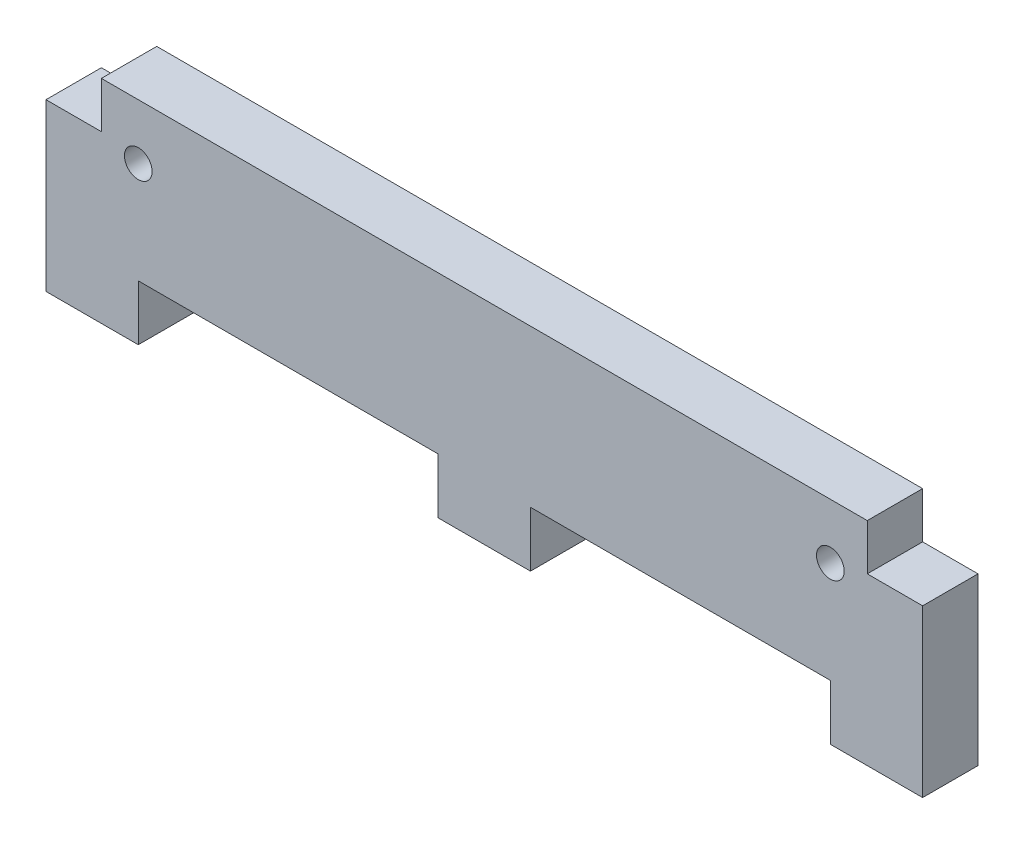
ISO-10303-21;
HEADER;
FILE_DESCRIPTION(('STEP AP214'),'2;1');
FILE_NAME('part.step','',(''),(''),'','','');
FILE_SCHEMA(('AUTOMOTIVE_DESIGN { 1 0 10303 214 1 1 1 1 }'));
ENDSEC;
DATA;
#1=APPLICATION_CONTEXT('core data for automotive mechanical design processes');
#2=APPLICATION_PROTOCOL_DEFINITION('international standard','automotive_design',2000,#1);
#3=PRODUCT_CONTEXT('',#1,'mechanical');
#4=PRODUCT('Part','Part','',(#3));
#5=PRODUCT_RELATED_PRODUCT_CATEGORY('part','',(#4));
#6=PRODUCT_DEFINITION_FORMATION('','',#4);
#7=PRODUCT_DEFINITION_CONTEXT('part definition',#1,'design');
#8=PRODUCT_DEFINITION('design','',#6,#7);
#9=PRODUCT_DEFINITION_SHAPE('','',#8);
#10=(LENGTH_UNIT() NAMED_UNIT(*) SI_UNIT(.MILLI.,.METRE.));
#11=(NAMED_UNIT(*) PLANE_ANGLE_UNIT() SI_UNIT($,.RADIAN.));
#12=(NAMED_UNIT(*) SI_UNIT($,.STERADIAN.) SOLID_ANGLE_UNIT());
#13=UNCERTAINTY_MEASURE_WITH_UNIT(LENGTH_MEASURE(1.E-05),#10,'distance_accuracy_value','');
#14=(GEOMETRIC_REPRESENTATION_CONTEXT(3) GLOBAL_UNCERTAINTY_ASSIGNED_CONTEXT((#13)) GLOBAL_UNIT_ASSIGNED_CONTEXT((#10,
#11,#12)) REPRESENTATION_CONTEXT('',''));
#15=CARTESIAN_POINT('',(0.,0.,0.));
#16=DIRECTION('',(0.,0.,1.));
#17=DIRECTION('',(1.,0.,0.));
#18=AXIS2_PLACEMENT_3D('',#15,#16,#17);
#19=CARTESIAN_POINT('',(0.,0.,6.));
#20=DIRECTION('',(0.,1.,0.));
#21=DIRECTION('',(0.,0.,1.));
#22=AXIS2_PLACEMENT_3D('',#19,#20,#21);
#23=PLANE('',#22);
#24=DIRECTION('',(1.,0.,0.));
#25=VECTOR('',#24,1.);
#26=CARTESIAN_POINT('',(0.,0.,0.));
#27=LINE('',#26,#25);
#28=CARTESIAN_POINT('',(0.,0.,0.));
#29=VERTEX_POINT('',#28);
#30=CARTESIAN_POINT('',(10.,0.,0.));
#31=VERTEX_POINT('',#30);
#32=EDGE_CURVE('E168',#29,#31,#27,.T.);
#33=ORIENTED_EDGE('',*,*,#32,.T.);
#34=DIRECTION('',(0.,0.,1.));
#35=VECTOR('',#34,1.);
#36=CARTESIAN_POINT('',(10.,0.,0.));
#37=LINE('',#36,#35);
#38=CARTESIAN_POINT('',(10.,0.,6.));
#39=VERTEX_POINT('',#38);
#40=EDGE_CURVE('E233',#31,#39,#37,.T.);
#41=ORIENTED_EDGE('',*,*,#40,.T.);
#42=DIRECTION('',(1.,0.,0.));
#43=VECTOR('',#42,1.);
#44=CARTESIAN_POINT('',(0.,0.,6.));
#45=LINE('',#44,#43);
#46=CARTESIAN_POINT('',(0.,0.,6.));
#47=VERTEX_POINT('',#46);
#48=EDGE_CURVE('E197',#47,#39,#45,.T.);
#49=ORIENTED_EDGE('',*,*,#48,.F.);
#50=DIRECTION('',(0.,0.,-1.));
#51=VECTOR('',#50,1.);
#52=CARTESIAN_POINT('',(0.,0.,6.));
#53=LINE('',#52,#51);
#54=EDGE_CURVE('E11',#47,#29,#53,.T.);
#55=ORIENTED_EDGE('',*,*,#54,.T.);
#56=EDGE_LOOP('',(#33,#41,#49,#55));
#57=FACE_BOUND('',#56,.T.);
#58=ADVANCED_FACE('F34',(#57),#23,.F.);
#59=CARTESIAN_POINT('',(42.5,0.,6.));
#60=VERTEX_POINT('',#59);
#61=CARTESIAN_POINT('',(52.5,0.,6.));
#62=VERTEX_POINT('',#61);
#63=EDGE_CURVE('E200',#60,#62,#45,.T.);
#64=ORIENTED_EDGE('',*,*,#63,.F.);
#65=DIRECTION('',(0.,0.,1.));
#66=VECTOR('',#65,1.);
#67=CARTESIAN_POINT('',(42.5,0.,0.));
#68=LINE('',#67,#66);
#69=CARTESIAN_POINT('',(42.5,0.,0.));
#70=VERTEX_POINT('',#69);
#71=EDGE_CURVE('E236',#70,#60,#68,.T.);
#72=ORIENTED_EDGE('',*,*,#71,.F.);
#73=CARTESIAN_POINT('',(52.5,0.,0.));
#74=VERTEX_POINT('',#73);
#75=EDGE_CURVE('E172',#70,#74,#27,.T.);
#76=ORIENTED_EDGE('',*,*,#75,.T.);
#77=DIRECTION('',(0.,0.,1.));
#78=VECTOR('',#77,1.);
#79=CARTESIAN_POINT('',(52.5,0.,0.));
#80=LINE('',#79,#78);
#81=EDGE_CURVE('E205',#74,#62,#80,.T.);
#82=ORIENTED_EDGE('',*,*,#81,.T.);
#83=EDGE_LOOP('',(#64,#72,#76,#82));
#84=FACE_BOUND('',#83,.T.);
#85=ADVANCED_FACE('F318',(#84),#23,.F.);
#86=CARTESIAN_POINT('',(0.,0.,6.));
#87=DIRECTION('',(1.,0.,0.));
#88=DIRECTION('',(0.,0.,-1.));
#89=AXIS2_PLACEMENT_3D('',#86,#87,#88);
#90=PLANE('',#89);
#91=DIRECTION('',(0.,-1.,0.));
#92=VECTOR('',#91,1.);
#93=CARTESIAN_POINT('',(0.,0.,6.));
#94=LINE('',#93,#92);
#95=CARTESIAN_POINT('',(0.,18.,6.));
#96=VERTEX_POINT('',#95);
#97=EDGE_CURVE('E162',#96,#47,#94,.T.);
#98=ORIENTED_EDGE('',*,*,#97,.F.);
#99=DIRECTION('',(0.,0.,1.));
#100=VECTOR('',#99,1.);
#101=CARTESIAN_POINT('',(0.,18.,0.));
#102=LINE('',#101,#100);
#103=CARTESIAN_POINT('',(0.,18.,0.));
#104=VERTEX_POINT('',#103);
#105=EDGE_CURVE('E150',#104,#96,#102,.T.);
#106=ORIENTED_EDGE('',*,*,#105,.F.);
#107=DIRECTION('',(0.,-1.,0.));
#108=VECTOR('',#107,1.);
#109=CARTESIAN_POINT('',(0.,0.,0.));
#110=LINE('',#109,#108);
#111=EDGE_CURVE('E160',#104,#29,#110,.T.);
#112=ORIENTED_EDGE('',*,*,#111,.T.);
#113=ORIENTED_EDGE('',*,*,#54,.F.);
#114=EDGE_LOOP('',(#98,#106,#112,#113));
#115=FACE_BOUND('',#114,.T.);
#116=ADVANCED_FACE('F36',(#115),#90,.F.);
#117=CARTESIAN_POINT('',(85.,0.,6.));
#118=VERTEX_POINT('',#117);
#119=CARTESIAN_POINT('',(95.,0.,6.));
#120=VERTEX_POINT('',#119);
#121=EDGE_CURVE('E202',#118,#120,#45,.T.);
#122=ORIENTED_EDGE('',*,*,#121,.F.);
#123=DIRECTION('',(0.,0.,1.));
#124=VECTOR('',#123,1.);
#125=CARTESIAN_POINT('',(85.,0.,0.));
#126=LINE('',#125,#124);
#127=CARTESIAN_POINT('',(85.,0.,0.));
#128=VERTEX_POINT('',#127);
#129=EDGE_CURVE('E208',#128,#118,#126,.T.);
#130=ORIENTED_EDGE('',*,*,#129,.F.);
#131=CARTESIAN_POINT('',(95.,0.,0.));
#132=VERTEX_POINT('',#131);
#133=EDGE_CURVE('E169',#128,#132,#27,.T.);
#134=ORIENTED_EDGE('',*,*,#133,.T.);
#135=DIRECTION('',(0.,0.,-1.));
#136=VECTOR('',#135,1.);
#137=CARTESIAN_POINT('',(95.,0.,6.));
#138=LINE('',#137,#136);
#139=EDGE_CURVE('E42',#120,#132,#138,.T.);
#140=ORIENTED_EDGE('',*,*,#139,.F.);
#141=EDGE_LOOP('',(#122,#130,#134,#140));
#142=FACE_BOUND('',#141,.T.);
#143=ADVANCED_FACE('F301',(#142),#23,.F.);
#144=CARTESIAN_POINT('',(95.,0.,6.));
#145=DIRECTION('',(-1.,0.,0.));
#146=DIRECTION('',(0.,0.,1.));
#147=AXIS2_PLACEMENT_3D('',#144,#145,#146);
#148=PLANE('',#147);
#149=DIRECTION('',(0.,1.,0.));
#150=VECTOR('',#149,1.);
#151=CARTESIAN_POINT('',(95.,0.,0.));
#152=LINE('',#151,#150);
#153=CARTESIAN_POINT('',(95.,18.,0.));
#154=VERTEX_POINT('',#153);
#155=EDGE_CURVE('E180',#132,#154,#152,.T.);
#156=ORIENTED_EDGE('',*,*,#155,.T.);
#157=DIRECTION('',(0.,0.,1.));
#158=VECTOR('',#157,1.);
#159=CARTESIAN_POINT('',(95.,18.,0.));
#160=LINE('',#159,#158);
#161=CARTESIAN_POINT('',(95.,18.,6.));
#162=VERTEX_POINT('',#161);
#163=EDGE_CURVE('E270',#154,#162,#160,.T.);
#164=ORIENTED_EDGE('',*,*,#163,.T.);
#165=DIRECTION('',(0.,1.,0.));
#166=VECTOR('',#165,1.);
#167=CARTESIAN_POINT('',(95.,0.,6.));
#168=LINE('',#167,#166);
#169=EDGE_CURVE('E191',#120,#162,#168,.T.);
#170=ORIENTED_EDGE('',*,*,#169,.F.);
#171=ORIENTED_EDGE('',*,*,#139,.T.);
#172=EDGE_LOOP('',(#156,#164,#170,#171));
#173=FACE_BOUND('',#172,.T.);
#174=ADVANCED_FACE('F296',(#173),#148,.F.);
#175=CARTESIAN_POINT('',(0.,23.,6.));
#176=DIRECTION('',(0.,-1.,0.));
#177=DIRECTION('',(0.,0.,-1.));
#178=AXIS2_PLACEMENT_3D('',#175,#176,#177);
#179=PLANE('',#178);
#180=DIRECTION('',(-1.,0.,0.));
#181=VECTOR('',#180,1.);
#182=CARTESIAN_POINT('',(0.,23.,0.));
#183=LINE('',#182,#181);
#184=CARTESIAN_POINT('',(89.,23.,0.));
#185=VERTEX_POINT('',#184);
#186=CARTESIAN_POINT('',(6.,23.,0.));
#187=VERTEX_POINT('',#186);
#188=EDGE_CURVE('E183',#185,#187,#183,.T.);
#189=ORIENTED_EDGE('',*,*,#188,.T.);
#190=DIRECTION('',(0.,0.,1.));
#191=VECTOR('',#190,1.);
#192=CARTESIAN_POINT('',(6.,23.,0.));
#193=LINE('',#192,#191);
#194=CARTESIAN_POINT('',(6.,23.,6.));
#195=VERTEX_POINT('',#194);
#196=EDGE_CURVE('E258',#187,#195,#193,.T.);
#197=ORIENTED_EDGE('',*,*,#196,.T.);
#198=DIRECTION('',(-1.,0.,0.));
#199=VECTOR('',#198,1.);
#200=CARTESIAN_POINT('',(0.,23.,6.));
#201=LINE('',#200,#199);
#202=CARTESIAN_POINT('',(89.,23.,6.));
#203=VERTEX_POINT('',#202);
#204=EDGE_CURVE('E177',#203,#195,#201,.T.);
#205=ORIENTED_EDGE('',*,*,#204,.F.);
#206=DIRECTION('',(0.,0.,1.));
#207=VECTOR('',#206,1.);
#208=CARTESIAN_POINT('',(89.,23.,0.));
#209=LINE('',#208,#207);
#210=EDGE_CURVE('E266',#185,#203,#209,.T.);
#211=ORIENTED_EDGE('',*,*,#210,.F.);
#212=EDGE_LOOP('',(#189,#197,#205,#211));
#213=FACE_BOUND('',#212,.T.);
#214=ADVANCED_FACE('F291',(#213),#179,.F.);
#215=CARTESIAN_POINT('',(0.,0.,6.));
#216=DIRECTION('',(0.,0.,-1.));
#217=DIRECTION('',(-1.,0.,0.));
#218=AXIS2_PLACEMENT_3D('',#215,#216,#217);
#219=PLANE('',#218);
#220=CARTESIAN_POINT('',(9.99999999999999,17.,6.));
#221=DIRECTION('',(0.,0.,1.));
#222=DIRECTION('',(1.,0.,0.));
#223=AXIS2_PLACEMENT_3D('',#220,#221,#222);
#224=CIRCLE('',#223,1.5);
#225=CARTESIAN_POINT('',(11.5,17.,6.));
#226=VERTEX_POINT('',#225);
#227=EDGE_CURVE('E261',#226,#226,#224,.T.);
#228=ORIENTED_EDGE('',*,*,#227,.F.);
#229=EDGE_LOOP('',(#228));
#230=FACE_BOUND('',#229,.T.);
#231=CARTESIAN_POINT('',(85.,17.,6.));
#232=DIRECTION('',(0.,0.,1.));
#233=DIRECTION('',(1.,0.,0.));
#234=AXIS2_PLACEMENT_3D('',#231,#232,#233);
#235=CIRCLE('',#234,1.5);
#236=CARTESIAN_POINT('',(86.5,17.,6.));
#237=VERTEX_POINT('',#236);
#238=EDGE_CURVE('E254',#237,#237,#235,.T.);
#239=ORIENTED_EDGE('',*,*,#238,.F.);
#240=EDGE_LOOP('',(#239));
#241=FACE_BOUND('',#240,.T.);
#242=ORIENTED_EDGE('',*,*,#204,.T.);
#243=DIRECTION('',(0.,1.,0.));
#244=VECTOR('',#243,1.);
#245=CARTESIAN_POINT('',(6.,23.,6.));
#246=LINE('',#245,#244);
#247=CARTESIAN_POINT('',(6.,18.,6.));
#248=VERTEX_POINT('',#247);
#249=EDGE_CURVE('E155',#248,#195,#246,.T.);
#250=ORIENTED_EDGE('',*,*,#249,.F.);
#251=DIRECTION('',(1.,0.,0.));
#252=VECTOR('',#251,1.);
#253=CARTESIAN_POINT('',(0.,18.,6.));
#254=LINE('',#253,#252);
#255=EDGE_CURVE('E273',#96,#248,#254,.T.);
#256=ORIENTED_EDGE('',*,*,#255,.F.);
#257=ORIENTED_EDGE('',*,*,#97,.T.);
#258=ORIENTED_EDGE('',*,*,#48,.T.);
#259=DIRECTION('',(0.,-1.,0.));
#260=VECTOR('',#259,1.);
#261=CARTESIAN_POINT('',(10.,0.,6.));
#262=LINE('',#261,#260);
#263=CARTESIAN_POINT('',(10.,6.,6.));
#264=VERTEX_POINT('',#263);
#265=EDGE_CURVE('E215',#264,#39,#262,.T.);
#266=ORIENTED_EDGE('',*,*,#265,.F.);
#267=DIRECTION('',(-1.,0.,0.));
#268=VECTOR('',#267,1.);
#269=CARTESIAN_POINT('',(10.,6.,6.));
#270=LINE('',#269,#268);
#271=CARTESIAN_POINT('',(42.5,6.,6.));
#272=VERTEX_POINT('',#271);
#273=EDGE_CURVE('E240',#272,#264,#270,.T.);
#274=ORIENTED_EDGE('',*,*,#273,.F.);
#275=DIRECTION('',(0.,1.,0.));
#276=VECTOR('',#275,1.);
#277=CARTESIAN_POINT('',(42.5,0.,6.));
#278=LINE('',#277,#276);
#279=EDGE_CURVE('E244',#60,#272,#278,.T.);
#280=ORIENTED_EDGE('',*,*,#279,.F.);
#281=ORIENTED_EDGE('',*,*,#63,.T.);
#282=DIRECTION('',(0.,-1.,0.));
#283=VECTOR('',#282,1.);
#284=CARTESIAN_POINT('',(52.5,0.,6.));
#285=LINE('',#284,#283);
#286=CARTESIAN_POINT('',(52.5,6.,6.));
#287=VERTEX_POINT('',#286);
#288=EDGE_CURVE('E223',#287,#62,#285,.T.);
#289=ORIENTED_EDGE('',*,*,#288,.F.);
#290=DIRECTION('',(-1.,0.,0.));
#291=VECTOR('',#290,1.);
#292=CARTESIAN_POINT('',(52.5,6.,6.));
#293=LINE('',#292,#291);
#294=CARTESIAN_POINT('',(85.,6.,6.));
#295=VERTEX_POINT('',#294);
#296=EDGE_CURVE('E216',#295,#287,#293,.T.);
#297=ORIENTED_EDGE('',*,*,#296,.F.);
#298=DIRECTION('',(0.,1.,0.));
#299=VECTOR('',#298,1.);
#300=CARTESIAN_POINT('',(85.,0.,6.));
#301=LINE('',#300,#299);
#302=EDGE_CURVE('E220',#118,#295,#301,.T.);
#303=ORIENTED_EDGE('',*,*,#302,.F.);
#304=ORIENTED_EDGE('',*,*,#121,.T.);
#305=ORIENTED_EDGE('',*,*,#169,.T.);
#306=DIRECTION('',(1.,0.,0.));
#307=VECTOR('',#306,1.);
#308=CARTESIAN_POINT('',(95.,18.,6.));
#309=LINE('',#308,#307);
#310=CARTESIAN_POINT('',(89.,18.,6.));
#311=VERTEX_POINT('',#310);
#312=EDGE_CURVE('E274',#311,#162,#309,.T.);
#313=ORIENTED_EDGE('',*,*,#312,.F.);
#314=DIRECTION('',(0.,-1.,0.));
#315=VECTOR('',#314,1.);
#316=CARTESIAN_POINT('',(89.,23.,6.));
#317=LINE('',#316,#315);
#318=EDGE_CURVE('E277',#203,#311,#317,.T.);
#319=ORIENTED_EDGE('',*,*,#318,.F.);
#320=EDGE_LOOP('',(#242,#250,#256,#257,#258,#266,#274,#280,#281,#289,#297,#303,#304,#305,#313,#319));
#321=FACE_BOUND('',#320,.T.);
#322=ADVANCED_FACE('F294',(#230,#241,#321),#219,.F.);
#323=CARTESIAN_POINT('',(0.,0.,0.));
#324=DIRECTION('',(0.,0.,-1.));
#325=DIRECTION('',(-1.,0.,0.));
#326=AXIS2_PLACEMENT_3D('',#323,#324,#325);
#327=PLANE('',#326);
#328=DIRECTION('',(0.,1.,0.));
#329=VECTOR('',#328,1.);
#330=CARTESIAN_POINT('',(6.,23.,0.));
#331=LINE('',#330,#329);
#332=CARTESIAN_POINT('',(6.,18.,0.));
#333=VERTEX_POINT('',#332);
#334=EDGE_CURVE('E49',#333,#187,#331,.T.);
#335=ORIENTED_EDGE('',*,*,#334,.T.);
#336=ORIENTED_EDGE('',*,*,#188,.F.);
#337=DIRECTION('',(0.,-1.,0.));
#338=VECTOR('',#337,1.);
#339=CARTESIAN_POINT('',(89.,23.,0.));
#340=LINE('',#339,#338);
#341=CARTESIAN_POINT('',(89.,18.,0.));
#342=VERTEX_POINT('',#341);
#343=EDGE_CURVE('E276',#185,#342,#340,.T.);
#344=ORIENTED_EDGE('',*,*,#343,.T.);
#345=DIRECTION('',(1.,0.,0.));
#346=VECTOR('',#345,1.);
#347=CARTESIAN_POINT('',(95.,18.,0.));
#348=LINE('',#347,#346);
#349=EDGE_CURVE('E57',#342,#154,#348,.T.);
#350=ORIENTED_EDGE('',*,*,#349,.T.);
#351=ORIENTED_EDGE('',*,*,#155,.F.);
#352=ORIENTED_EDGE('',*,*,#133,.F.);
#353=DIRECTION('',(0.,1.,0.));
#354=VECTOR('',#353,1.);
#355=CARTESIAN_POINT('',(85.,0.,0.));
#356=LINE('',#355,#354);
#357=CARTESIAN_POINT('',(85.,6.,0.));
#358=VERTEX_POINT('',#357);
#359=EDGE_CURVE('E228',#128,#358,#356,.T.);
#360=ORIENTED_EDGE('',*,*,#359,.T.);
#361=DIRECTION('',(-1.,0.,0.));
#362=VECTOR('',#361,1.);
#363=CARTESIAN_POINT('',(52.5,6.,0.));
#364=LINE('',#363,#362);
#365=CARTESIAN_POINT('',(52.5,6.,0.));
#366=VERTEX_POINT('',#365);
#367=EDGE_CURVE('E209',#358,#366,#364,.T.);
#368=ORIENTED_EDGE('',*,*,#367,.T.);
#369=DIRECTION('',(0.,-1.,0.));
#370=VECTOR('',#369,1.);
#371=CARTESIAN_POINT('',(52.5,0.,0.));
#372=LINE('',#371,#370);
#373=EDGE_CURVE('E219',#366,#74,#372,.T.);
#374=ORIENTED_EDGE('',*,*,#373,.T.);
#375=ORIENTED_EDGE('',*,*,#75,.F.);
#376=DIRECTION('',(0.,1.,0.));
#377=VECTOR('',#376,1.);
#378=CARTESIAN_POINT('',(42.5,0.,0.));
#379=LINE('',#378,#377);
#380=CARTESIAN_POINT('',(42.5,6.,0.));
#381=VERTEX_POINT('',#380);
#382=EDGE_CURVE('E250',#70,#381,#379,.T.);
#383=ORIENTED_EDGE('',*,*,#382,.T.);
#384=DIRECTION('',(-1.,0.,0.));
#385=VECTOR('',#384,1.);
#386=CARTESIAN_POINT('',(10.,6.,0.));
#387=LINE('',#386,#385);
#388=CARTESIAN_POINT('',(10.,6.,0.));
#389=VERTEX_POINT('',#388);
#390=EDGE_CURVE('E237',#381,#389,#387,.T.);
#391=ORIENTED_EDGE('',*,*,#390,.T.);
#392=DIRECTION('',(0.,-1.,0.));
#393=VECTOR('',#392,1.);
#394=CARTESIAN_POINT('',(10.,0.,0.));
#395=LINE('',#394,#393);
#396=EDGE_CURVE('E243',#389,#31,#395,.T.);
#397=ORIENTED_EDGE('',*,*,#396,.T.);
#398=ORIENTED_EDGE('',*,*,#32,.F.);
#399=ORIENTED_EDGE('',*,*,#111,.F.);
#400=DIRECTION('',(1.,0.,0.));
#401=VECTOR('',#400,1.);
#402=CARTESIAN_POINT('',(0.,18.,0.));
#403=LINE('',#402,#401);
#404=EDGE_CURVE('E146',#104,#333,#403,.T.);
#405=ORIENTED_EDGE('',*,*,#404,.T.);
#406=EDGE_LOOP('',(#335,#336,#344,#350,#351,#352,#360,#368,#374,#375,#383,#391,#397,#398,#399,#405));
#407=FACE_BOUND('',#406,.T.);
#408=CARTESIAN_POINT('',(9.99999999999999,17.,0.));
#409=DIRECTION('',(0.,0.,1.));
#410=DIRECTION('',(1.,0.,0.));
#411=AXIS2_PLACEMENT_3D('',#408,#409,#410);
#412=CIRCLE('',#411,1.5);
#413=CARTESIAN_POINT('',(11.5,17.,0.));
#414=VERTEX_POINT('',#413);
#415=EDGE_CURVE('E225',#414,#414,#412,.T.);
#416=ORIENTED_EDGE('',*,*,#415,.T.);
#417=EDGE_LOOP('',(#416));
#418=FACE_BOUND('',#417,.T.);
#419=CARTESIAN_POINT('',(85.,17.,0.));
#420=DIRECTION('',(0.,0.,1.));
#421=DIRECTION('',(1.,0.,0.));
#422=AXIS2_PLACEMENT_3D('',#419,#420,#421);
#423=CIRCLE('',#422,1.5);
#424=CARTESIAN_POINT('',(86.5,17.,0.));
#425=VERTEX_POINT('',#424);
#426=EDGE_CURVE('E257',#425,#425,#423,.T.);
#427=ORIENTED_EDGE('',*,*,#426,.T.);
#428=EDGE_LOOP('',(#427));
#429=FACE_BOUND('',#428,.T.);
#430=ADVANCED_FACE('F164',(#407,#418,#429),#327,.T.);
#431=CARTESIAN_POINT('',(52.5,0.,0.));
#432=DIRECTION('',(-1.,0.,0.));
#433=DIRECTION('',(0.,0.,1.));
#434=AXIS2_PLACEMENT_3D('',#431,#432,#433);
#435=PLANE('',#434);
#436=ORIENTED_EDGE('',*,*,#288,.T.);
#437=ORIENTED_EDGE('',*,*,#81,.F.);
#438=ORIENTED_EDGE('',*,*,#373,.F.);
#439=DIRECTION('',(0.,0.,1.));
#440=VECTOR('',#439,1.);
#441=CARTESIAN_POINT('',(52.5,6.,0.));
#442=LINE('',#441,#440);
#443=EDGE_CURVE('E213',#366,#287,#442,.T.);
#444=ORIENTED_EDGE('',*,*,#443,.T.);
#445=EDGE_LOOP('',(#436,#437,#438,#444));
#446=FACE_BOUND('',#445,.T.);
#447=ADVANCED_FACE('F371',(#446),#435,.F.);
#448=CARTESIAN_POINT('',(52.5,6.,0.));
#449=DIRECTION('',(0.,1.,0.));
#450=DIRECTION('',(0.,0.,1.));
#451=AXIS2_PLACEMENT_3D('',#448,#449,#450);
#452=PLANE('',#451);
#453=ORIENTED_EDGE('',*,*,#296,.T.);
#454=ORIENTED_EDGE('',*,*,#443,.F.);
#455=ORIENTED_EDGE('',*,*,#367,.F.);
#456=DIRECTION('',(0.,0.,1.));
#457=VECTOR('',#456,1.);
#458=CARTESIAN_POINT('',(85.,6.,0.));
#459=LINE('',#458,#457);
#460=EDGE_CURVE('E211',#358,#295,#459,.T.);
#461=ORIENTED_EDGE('',*,*,#460,.T.);
#462=EDGE_LOOP('',(#453,#454,#455,#461));
#463=FACE_BOUND('',#462,.T.);
#464=ADVANCED_FACE('F310',(#463),#452,.F.);
#465=CARTESIAN_POINT('',(85.,0.,0.));
#466=DIRECTION('',(1.,0.,0.));
#467=DIRECTION('',(0.,1.,0.));
#468=AXIS2_PLACEMENT_3D('',#465,#466,#467);
#469=PLANE('',#468);
#470=ORIENTED_EDGE('',*,*,#302,.T.);
#471=ORIENTED_EDGE('',*,*,#460,.F.);
#472=ORIENTED_EDGE('',*,*,#359,.F.);
#473=ORIENTED_EDGE('',*,*,#129,.T.);
#474=EDGE_LOOP('',(#470,#471,#472,#473));
#475=FACE_BOUND('',#474,.T.);
#476=ADVANCED_FACE('F304',(#475),#469,.F.);
#477=CARTESIAN_POINT('',(10.,0.,0.));
#478=DIRECTION('',(-1.,0.,0.));
#479=DIRECTION('',(0.,0.,1.));
#480=AXIS2_PLACEMENT_3D('',#477,#478,#479);
#481=PLANE('',#480);
#482=ORIENTED_EDGE('',*,*,#265,.T.);
#483=ORIENTED_EDGE('',*,*,#40,.F.);
#484=ORIENTED_EDGE('',*,*,#396,.F.);
#485=DIRECTION('',(0.,0.,1.));
#486=VECTOR('',#485,1.);
#487=CARTESIAN_POINT('',(10.,6.,0.));
#488=LINE('',#487,#486);
#489=EDGE_CURVE('E170',#389,#264,#488,.T.);
#490=ORIENTED_EDGE('',*,*,#489,.T.);
#491=EDGE_LOOP('',(#482,#483,#484,#490));
#492=FACE_BOUND('',#491,.T.);
#493=ADVANCED_FACE('F393',(#492),#481,.F.);
#494=CARTESIAN_POINT('',(10.,6.,0.));
#495=DIRECTION('',(0.,1.,0.));
#496=DIRECTION('',(0.,0.,1.));
#497=AXIS2_PLACEMENT_3D('',#494,#495,#496);
#498=PLANE('',#497);
#499=ORIENTED_EDGE('',*,*,#273,.T.);
#500=ORIENTED_EDGE('',*,*,#489,.F.);
#501=ORIENTED_EDGE('',*,*,#390,.F.);
#502=DIRECTION('',(0.,0.,1.));
#503=VECTOR('',#502,1.);
#504=CARTESIAN_POINT('',(42.5,6.,0.));
#505=LINE('',#504,#503);
#506=EDGE_CURVE('E174',#381,#272,#505,.T.);
#507=ORIENTED_EDGE('',*,*,#506,.T.);
#508=EDGE_LOOP('',(#499,#500,#501,#507));
#509=FACE_BOUND('',#508,.T.);
#510=ADVANCED_FACE('F326',(#509),#498,.F.);
#511=CARTESIAN_POINT('',(42.5,0.,0.));
#512=DIRECTION('',(1.,0.,0.));
#513=DIRECTION('',(0.,0.,-1.));
#514=AXIS2_PLACEMENT_3D('',#511,#512,#513);
#515=PLANE('',#514);
#516=ORIENTED_EDGE('',*,*,#279,.T.);
#517=ORIENTED_EDGE('',*,*,#506,.F.);
#518=ORIENTED_EDGE('',*,*,#382,.F.);
#519=ORIENTED_EDGE('',*,*,#71,.T.);
#520=EDGE_LOOP('',(#516,#517,#518,#519));
#521=FACE_BOUND('',#520,.T.);
#522=ADVANCED_FACE('F321',(#521),#515,.F.);
#523=CARTESIAN_POINT('',(85.,17.,0.));
#524=DIRECTION('',(0.,0.,1.));
#525=DIRECTION('',(1.,0.,0.));
#526=AXIS2_PLACEMENT_3D('',#523,#524,#525);
#527=CYLINDRICAL_SURFACE('',#526,1.5);
#528=ORIENTED_EDGE('',*,*,#426,.F.);
#529=EDGE_LOOP('',(#528));
#530=FACE_BOUND('',#529,.T.);
#531=ORIENTED_EDGE('',*,*,#238,.T.);
#532=EDGE_LOOP('',(#531));
#533=FACE_BOUND('',#532,.T.);
#534=ADVANCED_FACE('F418',(#530,#533),#527,.F.);
#535=CARTESIAN_POINT('',(9.99999999999999,17.,0.));
#536=DIRECTION('',(0.,0.,1.));
#537=DIRECTION('',(1.,0.,0.));
#538=AXIS2_PLACEMENT_3D('',#535,#536,#537);
#539=CYLINDRICAL_SURFACE('',#538,1.5);
#540=ORIENTED_EDGE('',*,*,#415,.F.);
#541=EDGE_LOOP('',(#540));
#542=FACE_BOUND('',#541,.T.);
#543=ORIENTED_EDGE('',*,*,#227,.T.);
#544=EDGE_LOOP('',(#543));
#545=FACE_BOUND('',#544,.T.);
#546=ADVANCED_FACE('F426',(#542,#545),#539,.F.);
#547=CARTESIAN_POINT('',(95.,18.,0.));
#548=DIRECTION('',(0.,-1.,0.));
#549=DIRECTION('',(1.,0.,0.));
#550=AXIS2_PLACEMENT_3D('',#547,#548,#549);
#551=PLANE('',#550);
#552=ORIENTED_EDGE('',*,*,#312,.T.);
#553=ORIENTED_EDGE('',*,*,#163,.F.);
#554=ORIENTED_EDGE('',*,*,#349,.F.);
#555=DIRECTION('',(0.,0.,1.));
#556=VECTOR('',#555,1.);
#557=CARTESIAN_POINT('',(89.,18.,0.));
#558=LINE('',#557,#556);
#559=EDGE_CURVE('E268',#342,#311,#558,.T.);
#560=ORIENTED_EDGE('',*,*,#559,.T.);
#561=EDGE_LOOP('',(#552,#553,#554,#560));
#562=FACE_BOUND('',#561,.T.);
#563=ADVANCED_FACE('F295',(#562),#551,.F.);
#564=CARTESIAN_POINT('',(89.,23.,0.));
#565=DIRECTION('',(-1.,0.,0.));
#566=DIRECTION('',(0.,0.,1.));
#567=AXIS2_PLACEMENT_3D('',#564,#565,#566);
#568=PLANE('',#567);
#569=ORIENTED_EDGE('',*,*,#318,.T.);
#570=ORIENTED_EDGE('',*,*,#559,.F.);
#571=ORIENTED_EDGE('',*,*,#343,.F.);
#572=ORIENTED_EDGE('',*,*,#210,.T.);
#573=EDGE_LOOP('',(#569,#570,#571,#572));
#574=FACE_BOUND('',#573,.T.);
#575=ADVANCED_FACE('F293',(#574),#568,.F.);
#576=CARTESIAN_POINT('',(6.,23.,0.));
#577=DIRECTION('',(1.,0.,0.));
#578=DIRECTION('',(0.,1.,0.));
#579=AXIS2_PLACEMENT_3D('',#576,#577,#578);
#580=PLANE('',#579);
#581=ORIENTED_EDGE('',*,*,#249,.T.);
#582=ORIENTED_EDGE('',*,*,#196,.F.);
#583=ORIENTED_EDGE('',*,*,#334,.F.);
#584=DIRECTION('',(0.,0.,1.));
#585=VECTOR('',#584,1.);
#586=CARTESIAN_POINT('',(6.,18.,0.));
#587=LINE('',#586,#585);
#588=EDGE_CURVE('E152',#333,#248,#587,.T.);
#589=ORIENTED_EDGE('',*,*,#588,.T.);
#590=EDGE_LOOP('',(#581,#582,#583,#589));
#591=FACE_BOUND('',#590,.T.);
#592=ADVANCED_FACE('F331',(#591),#580,.F.);
#593=CARTESIAN_POINT('',(0.,18.,0.));
#594=DIRECTION('',(0.,-1.,0.));
#595=DIRECTION('',(0.,0.,-1.));
#596=AXIS2_PLACEMENT_3D('',#593,#594,#595);
#597=PLANE('',#596);
#598=ORIENTED_EDGE('',*,*,#255,.T.);
#599=ORIENTED_EDGE('',*,*,#588,.F.);
#600=ORIENTED_EDGE('',*,*,#404,.F.);
#601=ORIENTED_EDGE('',*,*,#105,.T.);
#602=EDGE_LOOP('',(#598,#599,#600,#601));
#603=FACE_BOUND('',#602,.T.);
#604=ADVANCED_FACE('F149',(#603),#597,.F.);
#605=CLOSED_SHELL('',(#58,#85,#116,#143,#174,#214,#322,#430,#447,#464,#476,#493,#510,#522,#534,
#546,#563,#575,#592,#604));
#606=MANIFOLD_SOLID_BREP('B2',#605);
#607=ADVANCED_BREP_SHAPE_REPRESENTATION('',(#18,#606),#14);
#608=SHAPE_DEFINITION_REPRESENTATION(#9,#607);
ENDSEC;
END-ISO-10303-21;
